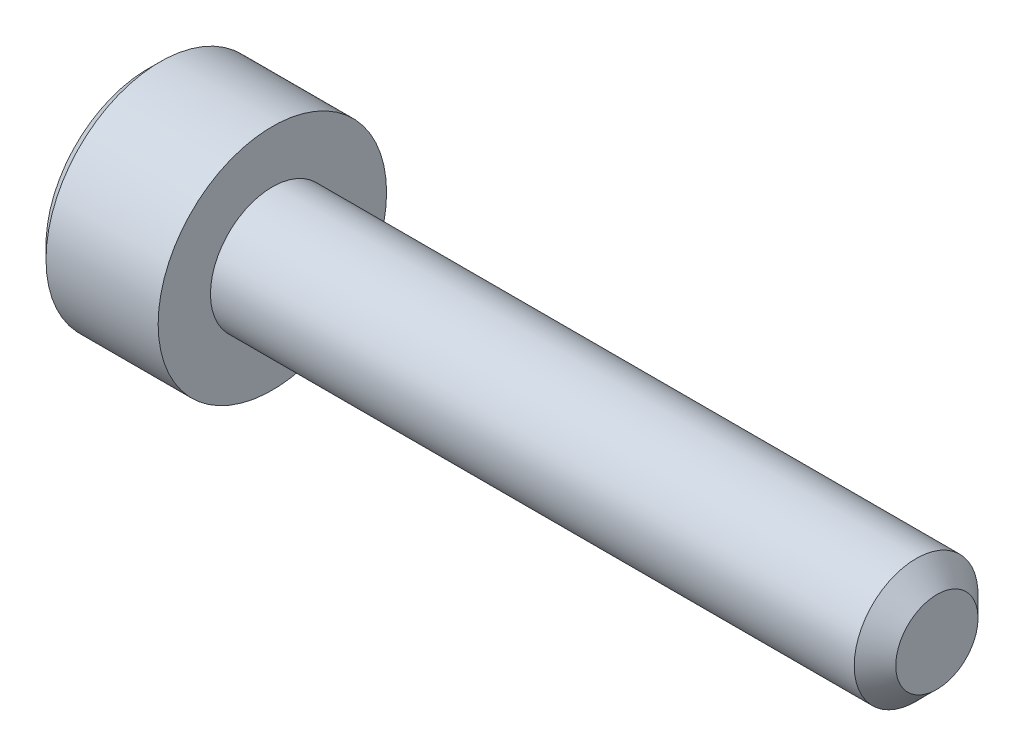
ISO-10303-21;
HEADER;
FILE_DESCRIPTION(('STEP AP214'),'2;1');
FILE_NAME('part.step','',(''),(''),'','','');
FILE_SCHEMA(('AUTOMOTIVE_DESIGN { 1 0 10303 214 1 1 1 1 }'));
ENDSEC;
DATA;
#1=APPLICATION_CONTEXT('core data for automotive mechanical design processes');
#2=APPLICATION_PROTOCOL_DEFINITION('international standard','automotive_design',2000,#1);
#3=PRODUCT_CONTEXT('',#1,'mechanical');
#4=PRODUCT('Part','Part','',(#3));
#5=PRODUCT_RELATED_PRODUCT_CATEGORY('part','',(#4));
#6=PRODUCT_DEFINITION_FORMATION('','',#4);
#7=PRODUCT_DEFINITION_CONTEXT('part definition',#1,'design');
#8=PRODUCT_DEFINITION('design','',#6,#7);
#9=PRODUCT_DEFINITION_SHAPE('','',#8);
#10=(LENGTH_UNIT() NAMED_UNIT(*) SI_UNIT(.MILLI.,.METRE.));
#11=(NAMED_UNIT(*) PLANE_ANGLE_UNIT() SI_UNIT($,.RADIAN.));
#12=(NAMED_UNIT(*) SI_UNIT($,.STERADIAN.) SOLID_ANGLE_UNIT());
#13=UNCERTAINTY_MEASURE_WITH_UNIT(LENGTH_MEASURE(1.E-05),#10,'distance_accuracy_value','');
#14=(GEOMETRIC_REPRESENTATION_CONTEXT(3) GLOBAL_UNCERTAINTY_ASSIGNED_CONTEXT((#13)) GLOBAL_UNIT_ASSIGNED_CONTEXT((#10,
#11,#12)) REPRESENTATION_CONTEXT('',''));
#15=CARTESIAN_POINT('',(0.,0.,0.));
#16=DIRECTION('',(0.,0.,1.));
#17=DIRECTION('',(1.,0.,0.));
#18=AXIS2_PLACEMENT_3D('',#15,#16,#17);
#19=CARTESIAN_POINT('',(0.,0.,0.));
#20=DIRECTION('',(1.,0.,0.));
#21=DIRECTION('',(0.,0.,-1.));
#22=AXIS2_PLACEMENT_3D('',#19,#20,#21);
#23=PLANE('',#22);
#24=DIRECTION('',(0.,0.866025403784439,0.5));
#25=VECTOR('',#24,1.);
#26=CARTESIAN_POINT('',(0.,1.4,-0.98149545762236));
#27=LINE('',#26,#25);
#28=CARTESIAN_POINT('',(0.,0.,-1.78978583448784));
#29=VERTEX_POINT('',#28);
#30=CARTESIAN_POINT('',(0.,1.55,-0.894892917243917));
#31=VERTEX_POINT('',#30);
#32=EDGE_CURVE('E154',#29,#31,#27,.T.);
#33=ORIENTED_EDGE('',*,*,#32,.T.);
#34=DIRECTION('',(0.,0.,1.));
#35=VECTOR('',#34,1.);
#36=CARTESIAN_POINT('',(0.,1.55,0.721687836487032));
#37=LINE('',#36,#35);
#38=CARTESIAN_POINT('',(0.,1.55,0.894892917243918));
#39=VERTEX_POINT('',#38);
#40=EDGE_CURVE('E164',#31,#39,#37,.T.);
#41=ORIENTED_EDGE('',*,*,#40,.T.);
#42=DIRECTION('',(0.,-0.866025403784439,0.5));
#43=VECTOR('',#42,1.);
#44=CARTESIAN_POINT('',(0.,0.149999999999999,1.7031832941094));
#45=LINE('',#44,#43);
#46=CARTESIAN_POINT('',(0.,0.,1.78978583448784));
#47=VERTEX_POINT('',#46);
#48=EDGE_CURVE('E162',#39,#47,#45,.T.);
#49=ORIENTED_EDGE('',*,*,#48,.T.);
#50=DIRECTION('',(0.,-0.866025403784439,-0.5));
#51=VECTOR('',#50,1.);
#52=CARTESIAN_POINT('',(0.,-1.4,0.981495457622362));
#53=LINE('',#52,#51);
#54=CARTESIAN_POINT('',(0.,-1.55,0.894892917243919));
#55=VERTEX_POINT('',#54);
#56=EDGE_CURVE('E160',#47,#55,#53,.T.);
#57=ORIENTED_EDGE('',*,*,#56,.T.);
#58=DIRECTION('',(0.,0.,-1.));
#59=VECTOR('',#58,1.);
#60=CARTESIAN_POINT('',(0.,-1.55,-0.721687836487031));
#61=LINE('',#60,#59);
#62=CARTESIAN_POINT('',(0.,-1.55,-0.894892917243918));
#63=VERTEX_POINT('',#62);
#64=EDGE_CURVE('E158',#55,#63,#61,.T.);
#65=ORIENTED_EDGE('',*,*,#64,.T.);
#66=DIRECTION('',(0.,0.866025403784439,-0.5));
#67=VECTOR('',#66,1.);
#68=CARTESIAN_POINT('',(0.,-0.149999999999998,-1.70318329410939));
#69=LINE('',#68,#67);
#70=EDGE_CURVE('E156',#63,#29,#69,.T.);
#71=ORIENTED_EDGE('',*,*,#70,.T.);
#72=EDGE_LOOP('',(#33,#41,#49,#57,#65,#71));
#73=FACE_BOUND('',#72,.T.);
#74=CARTESIAN_POINT('',(0.,0.,0.));
#75=DIRECTION('',(1.,0.,0.));
#76=DIRECTION('',(0.,0.,-1.));
#77=AXIS2_PLACEMENT_3D('',#74,#75,#76);
#78=CIRCLE('',#77,2.44999999999999);
#79=CARTESIAN_POINT('',(0.,0.,-2.44999999999999));
#80=VERTEX_POINT('',#79);
#81=EDGE_CURVE('E148',#80,#80,#78,.F.);
#82=ORIENTED_EDGE('',*,*,#81,.T.);
#83=EDGE_LOOP('',(#82));
#84=FACE_BOUND('',#83,.T.);
#85=ADVANCED_FACE('F33',(#73,#84),#23,.F.);
#86=CARTESIAN_POINT('',(19.,0.,0.));
#87=DIRECTION('',(-1.,0.,0.));
#88=DIRECTION('',(0.,0.,1.));
#89=AXIS2_PLACEMENT_3D('',#86,#87,#88);
#90=PLANE('',#89);
#91=CARTESIAN_POINT('',(19.,0.,0.));
#92=DIRECTION('',(-1.,0.,0.));
#93=DIRECTION('',(0.,0.,1.));
#94=AXIS2_PLACEMENT_3D('',#91,#92,#93);
#95=CIRCLE('',#94,0.989999999999996);
#96=CARTESIAN_POINT('',(19.,0.,0.989999999999996));
#97=VERTEX_POINT('',#96);
#98=EDGE_CURVE('E145',#97,#97,#95,.F.);
#99=ORIENTED_EDGE('',*,*,#98,.T.);
#100=EDGE_LOOP('',(#99));
#101=FACE_BOUND('',#100,.T.);
#102=ADVANCED_FACE('F244',(#101),#90,.F.);
#103=CARTESIAN_POINT('',(-88.7054908485857,0.,0.));
#104=DIRECTION('',(-1.,0.,0.));
#105=DIRECTION('',(0.,0.,1.));
#106=AXIS2_PLACEMENT_3D('',#103,#104,#105);
#107=CYLINDRICAL_SURFACE('',#106,1.49);
#108=CARTESIAN_POINT('',(18.5,0.,0.));
#109=DIRECTION('',(-1.,0.,0.));
#110=DIRECTION('',(0.,0.,1.));
#111=AXIS2_PLACEMENT_3D('',#108,#109,#110);
#112=CIRCLE('',#111,1.49);
#113=CARTESIAN_POINT('',(18.5,0.,1.49));
#114=VERTEX_POINT('',#113);
#115=EDGE_CURVE('E142',#114,#114,#112,.T.);
#116=ORIENTED_EDGE('',*,*,#115,.T.);
#117=EDGE_LOOP('',(#116));
#118=FACE_BOUND('',#117,.T.);
#119=CARTESIAN_POINT('',(3.,0.,0.));
#120=DIRECTION('',(-1.,0.,0.));
#121=DIRECTION('',(0.,0.,1.));
#122=AXIS2_PLACEMENT_3D('',#119,#120,#121);
#123=CIRCLE('',#122,1.49);
#124=CARTESIAN_POINT('',(3.,0.,1.49));
#125=VERTEX_POINT('',#124);
#126=EDGE_CURVE('E134',#125,#125,#123,.T.);
#127=ORIENTED_EDGE('',*,*,#126,.F.);
#128=EDGE_LOOP('',(#127));
#129=FACE_BOUND('',#128,.T.);
#130=ADVANCED_FACE('F249',(#118,#129),#107,.T.);
#131=CARTESIAN_POINT('',(3.,1.49,0.));
#132=DIRECTION('',(-1.,0.,0.));
#133=DIRECTION('',(0.,0.,1.));
#134=AXIS2_PLACEMENT_3D('',#131,#132,#133);
#135=PLANE('',#134);
#136=CARTESIAN_POINT('',(3.,0.,0.));
#137=DIRECTION('',(-1.,0.,0.));
#138=DIRECTION('',(0.,0.,1.));
#139=AXIS2_PLACEMENT_3D('',#136,#137,#138);
#140=CIRCLE('',#139,2.75);
#141=CARTESIAN_POINT('',(3.,0.,2.75));
#142=VERTEX_POINT('',#141);
#143=EDGE_CURVE('E130',#142,#142,#140,.T.);
#144=ORIENTED_EDGE('',*,*,#143,.F.);
#145=EDGE_LOOP('',(#144));
#146=FACE_BOUND('',#145,.T.);
#147=ORIENTED_EDGE('',*,*,#126,.T.);
#148=EDGE_LOOP('',(#147));
#149=FACE_BOUND('',#148,.T.);
#150=ADVANCED_FACE('F259',(#146,#149),#135,.F.);
#151=CARTESIAN_POINT('',(-88.7054908485857,0.,0.));
#152=DIRECTION('',(-1.,0.,0.));
#153=DIRECTION('',(0.,0.,1.));
#154=AXIS2_PLACEMENT_3D('',#151,#152,#153);
#155=CYLINDRICAL_SURFACE('',#154,2.75);
#156=CARTESIAN_POINT('',(0.300000000000009,0.,0.));
#157=DIRECTION('',(1.,0.,0.));
#158=DIRECTION('',(0.,0.,-1.));
#159=AXIS2_PLACEMENT_3D('',#156,#157,#158);
#160=CIRCLE('',#159,2.75);
#161=CARTESIAN_POINT('',(0.300000000000009,0.,-2.75));
#162=VERTEX_POINT('',#161);
#163=EDGE_CURVE('E151',#162,#162,#160,.T.);
#164=ORIENTED_EDGE('',*,*,#163,.T.);
#165=EDGE_LOOP('',(#164));
#166=FACE_BOUND('',#165,.T.);
#167=ORIENTED_EDGE('',*,*,#143,.T.);
#168=EDGE_LOOP('',(#167));
#169=FACE_BOUND('',#168,.T.);
#170=ADVANCED_FACE('F255',(#166,#169),#155,.T.);
#171=CARTESIAN_POINT('',(18.5,0.,0.));
#172=DIRECTION('',(-1.,0.,0.));
#173=DIRECTION('',(0.,0.,1.));
#174=AXIS2_PLACEMENT_3D('',#171,#172,#173);
#175=CONICAL_SURFACE('',#174,1.49,0.785398163397454);
#176=ORIENTED_EDGE('',*,*,#98,.F.);
#177=EDGE_LOOP('',(#176));
#178=FACE_BOUND('',#177,.T.);
#179=ORIENTED_EDGE('',*,*,#115,.F.);
#180=EDGE_LOOP('',(#179));
#181=FACE_BOUND('',#180,.T.);
#182=ADVANCED_FACE('F258',(#178,#181),#175,.T.);
#183=CARTESIAN_POINT('',(0.,0.,0.));
#184=DIRECTION('',(1.,0.,0.));
#185=DIRECTION('',(0.,0.,-1.));
#186=AXIS2_PLACEMENT_3D('',#183,#184,#185);
#187=CONICAL_SURFACE('',#186,2.44999999999999,0.78539816339745);
#188=ORIENTED_EDGE('',*,*,#163,.F.);
#189=EDGE_LOOP('',(#188));
#190=FACE_BOUND('',#189,.T.);
#191=ORIENTED_EDGE('',*,*,#81,.F.);
#192=EDGE_LOOP('',(#191));
#193=FACE_BOUND('',#192,.T.);
#194=ADVANCED_FACE('F269',(#190,#193),#187,.T.);
#195=CARTESIAN_POINT('',(2.5,1.25,0.721687836487032));
#196=DIRECTION('',(0.,-0.5,-0.866025403784438));
#197=DIRECTION('',(0.,0.866025403784439,-0.5));
#198=AXIS2_PLACEMENT_3D('',#195,#196,#197);
#199=PLANE('',#198);
#200=DIRECTION('',(-1.,0.,0.));
#201=VECTOR('',#200,1.);
#202=CARTESIAN_POINT('',(2.5,0.,1.44337567297407));
#203=LINE('',#202,#201);
#204=CARTESIAN_POINT('',(2.5,0.,1.44337567297407));
#205=VERTEX_POINT('',#204);
#206=CARTESIAN_POINT('',(0.299999999999998,0.,1.44337567297407));
#207=VERTEX_POINT('',#206);
#208=EDGE_CURVE('E122',#205,#207,#203,.T.);
#209=ORIENTED_EDGE('',*,*,#208,.T.);
#210=DIRECTION('',(0.,0.866025403784439,-0.5));
#211=VECTOR('',#210,1.);
#212=CARTESIAN_POINT('',(0.299999999999998,1.25,0.721687836487032));
#213=LINE('',#212,#211);
#214=CARTESIAN_POINT('',(0.299999999999998,1.25,0.721687836487032));
#215=VERTEX_POINT('',#214);
#216=EDGE_CURVE('E170',#207,#215,#213,.T.);
#217=ORIENTED_EDGE('',*,*,#216,.T.);
#218=DIRECTION('',(-1.,0.,0.));
#219=VECTOR('',#218,1.);
#220=CARTESIAN_POINT('',(2.5,1.25,0.721687836487032));
#221=LINE('',#220,#219);
#222=CARTESIAN_POINT('',(2.5,1.25,0.721687836487032));
#223=VERTEX_POINT('',#222);
#224=EDGE_CURVE('E125',#223,#215,#221,.T.);
#225=ORIENTED_EDGE('',*,*,#224,.F.);
#226=DIRECTION('',(0.,-0.866025403784439,0.5));
#227=VECTOR('',#226,1.);
#228=CARTESIAN_POINT('',(2.5,1.25,0.721687836487032));
#229=LINE('',#228,#227);
#230=EDGE_CURVE('E110',#223,#205,#229,.T.);
#231=ORIENTED_EDGE('',*,*,#230,.T.);
#232=EDGE_LOOP('',(#209,#217,#225,#231));
#233=FACE_BOUND('',#232,.T.);
#234=ADVANCED_FACE('F121',(#233),#199,.T.);
#235=CARTESIAN_POINT('',(2.5,0.,1.44337567297407));
#236=DIRECTION('',(0.,0.5,-0.866025403784438));
#237=DIRECTION('',(0.,0.866025403784439,0.5));
#238=AXIS2_PLACEMENT_3D('',#235,#236,#237);
#239=PLANE('',#238);
#240=DIRECTION('',(-1.,0.,0.));
#241=VECTOR('',#240,1.);
#242=CARTESIAN_POINT('',(2.5,-1.25,0.721687836487033));
#243=LINE('',#242,#241);
#244=CARTESIAN_POINT('',(2.5,-1.25,0.721687836487033));
#245=VERTEX_POINT('',#244);
#246=CARTESIAN_POINT('',(0.299999999999998,-1.25,0.721687836487033));
#247=VERTEX_POINT('',#246);
#248=EDGE_CURVE('E131',#245,#247,#243,.T.);
#249=ORIENTED_EDGE('',*,*,#248,.T.);
#250=DIRECTION('',(0.,0.866025403784439,0.5));
#251=VECTOR('',#250,1.);
#252=CARTESIAN_POINT('',(0.299999999999998,0.,1.44337567297407));
#253=LINE('',#252,#251);
#254=EDGE_CURVE('E129',#247,#207,#253,.T.);
#255=ORIENTED_EDGE('',*,*,#254,.T.);
#256=ORIENTED_EDGE('',*,*,#208,.F.);
#257=DIRECTION('',(0.,-0.866025403784439,-0.5));
#258=VECTOR('',#257,1.);
#259=CARTESIAN_POINT('',(2.5,0.,1.44337567297407));
#260=LINE('',#259,#258);
#261=EDGE_CURVE('E106',#205,#245,#260,.T.);
#262=ORIENTED_EDGE('',*,*,#261,.T.);
#263=EDGE_LOOP('',(#249,#255,#256,#262));
#264=FACE_BOUND('',#263,.T.);
#265=ADVANCED_FACE('F127',(#264),#239,.T.);
#266=CARTESIAN_POINT('',(2.5,-1.25,0.721687836487033));
#267=DIRECTION('',(0.,1.,0.));
#268=DIRECTION('',(0.,0.,1.));
#269=AXIS2_PLACEMENT_3D('',#266,#267,#268);
#270=PLANE('',#269);
#271=DIRECTION('',(-1.,0.,0.));
#272=VECTOR('',#271,1.);
#273=CARTESIAN_POINT('',(2.5,-1.25,-0.721687836487031));
#274=LINE('',#273,#272);
#275=CARTESIAN_POINT('',(2.5,-1.25,-0.721687836487031));
#276=VERTEX_POINT('',#275);
#277=CARTESIAN_POINT('',(0.299999999999998,-1.25,-0.721687836487031));
#278=VERTEX_POINT('',#277);
#279=EDGE_CURVE('E136',#276,#278,#274,.T.);
#280=ORIENTED_EDGE('',*,*,#279,.T.);
#281=DIRECTION('',(0.,0.,1.));
#282=VECTOR('',#281,1.);
#283=CARTESIAN_POINT('',(0.299999999999998,-1.25,0.721687836487033));
#284=LINE('',#283,#282);
#285=EDGE_CURVE('E173',#278,#247,#284,.T.);
#286=ORIENTED_EDGE('',*,*,#285,.T.);
#287=ORIENTED_EDGE('',*,*,#248,.F.);
#288=DIRECTION('',(0.,0.,-1.));
#289=VECTOR('',#288,1.);
#290=CARTESIAN_POINT('',(2.5,-1.25,0.721687836487033));
#291=LINE('',#290,#289);
#292=EDGE_CURVE('E112',#245,#276,#291,.T.);
#293=ORIENTED_EDGE('',*,*,#292,.T.);
#294=EDGE_LOOP('',(#280,#286,#287,#293));
#295=FACE_BOUND('',#294,.T.);
#296=ADVANCED_FACE('F200',(#295),#270,.T.);
#297=CARTESIAN_POINT('',(2.5,-1.25,-0.721687836487031));
#298=DIRECTION('',(0.,0.5,0.866025403784439));
#299=DIRECTION('',(0.,-0.866025403784439,0.5));
#300=AXIS2_PLACEMENT_3D('',#297,#298,#299);
#301=PLANE('',#300);
#302=DIRECTION('',(-1.,0.,0.));
#303=VECTOR('',#302,1.);
#304=CARTESIAN_POINT('',(2.5,0.,-1.44337567297406));
#305=LINE('',#304,#303);
#306=CARTESIAN_POINT('',(2.5,0.,-1.44337567297406));
#307=VERTEX_POINT('',#306);
#308=CARTESIAN_POINT('',(0.299999999999998,0.,-1.44337567297406));
#309=VERTEX_POINT('',#308);
#310=EDGE_CURVE('E201',#307,#309,#305,.T.);
#311=ORIENTED_EDGE('',*,*,#310,.T.);
#312=DIRECTION('',(0.,-0.866025403784439,0.5));
#313=VECTOR('',#312,1.);
#314=CARTESIAN_POINT('',(0.299999999999998,-1.25,-0.721687836487031));
#315=LINE('',#314,#313);
#316=EDGE_CURVE('E42',#309,#278,#315,.T.);
#317=ORIENTED_EDGE('',*,*,#316,.T.);
#318=ORIENTED_EDGE('',*,*,#279,.F.);
#319=DIRECTION('',(0.,0.866025403784439,-0.499999999999999));
#320=VECTOR('',#319,1.);
#321=CARTESIAN_POINT('',(2.5,-1.25,-0.721687836487031));
#322=LINE('',#321,#320);
#323=EDGE_CURVE('E211',#276,#307,#322,.T.);
#324=ORIENTED_EDGE('',*,*,#323,.T.);
#325=EDGE_LOOP('',(#311,#317,#318,#324));
#326=FACE_BOUND('',#325,.T.);
#327=ADVANCED_FACE('F213',(#326),#301,.T.);
#328=CARTESIAN_POINT('',(2.5,0.,-1.44337567297406));
#329=DIRECTION('',(0.,-0.5,0.866025403784439));
#330=DIRECTION('',(0.,-0.866025403784439,-0.5));
#331=AXIS2_PLACEMENT_3D('',#328,#329,#330);
#332=PLANE('',#331);
#333=DIRECTION('',(-1.,0.,0.));
#334=VECTOR('',#333,1.);
#335=CARTESIAN_POINT('',(2.5,1.25,-0.72168783648703));
#336=LINE('',#335,#334);
#337=CARTESIAN_POINT('',(2.5,1.25,-0.72168783648703));
#338=VERTEX_POINT('',#337);
#339=CARTESIAN_POINT('',(0.299999999999998,1.25,-0.72168783648703));
#340=VERTEX_POINT('',#339);
#341=EDGE_CURVE('E202',#338,#340,#336,.T.);
#342=ORIENTED_EDGE('',*,*,#341,.T.);
#343=DIRECTION('',(0.,-0.866025403784439,-0.5));
#344=VECTOR('',#343,1.);
#345=CARTESIAN_POINT('',(0.299999999999998,0.,-1.44337567297406));
#346=LINE('',#345,#344);
#347=EDGE_CURVE('E11',#340,#309,#346,.T.);
#348=ORIENTED_EDGE('',*,*,#347,.T.);
#349=ORIENTED_EDGE('',*,*,#310,.F.);
#350=DIRECTION('',(0.,0.866025403784438,0.5));
#351=VECTOR('',#350,1.);
#352=CARTESIAN_POINT('',(2.5,0.,-1.44337567297406));
#353=LINE('',#352,#351);
#354=EDGE_CURVE('E209',#307,#338,#353,.T.);
#355=ORIENTED_EDGE('',*,*,#354,.T.);
#356=EDGE_LOOP('',(#342,#348,#349,#355));
#357=FACE_BOUND('',#356,.T.);
#358=ADVANCED_FACE('F215',(#357),#332,.T.);
#359=CARTESIAN_POINT('',(2.5,1.25,-0.72168783648703));
#360=DIRECTION('',(0.,-1.,0.));
#361=DIRECTION('',(0.,0.,-1.));
#362=AXIS2_PLACEMENT_3D('',#359,#360,#361);
#363=PLANE('',#362);
#364=ORIENTED_EDGE('',*,*,#224,.T.);
#365=DIRECTION('',(0.,0.,-1.));
#366=VECTOR('',#365,1.);
#367=CARTESIAN_POINT('',(0.299999999999998,1.25,-0.72168783648703));
#368=LINE('',#367,#366);
#369=EDGE_CURVE('E167',#215,#340,#368,.T.);
#370=ORIENTED_EDGE('',*,*,#369,.T.);
#371=ORIENTED_EDGE('',*,*,#341,.F.);
#372=DIRECTION('',(0.,0.,1.));
#373=VECTOR('',#372,1.);
#374=CARTESIAN_POINT('',(2.5,1.25,-0.72168783648703));
#375=LINE('',#374,#373);
#376=EDGE_CURVE('E207',#338,#223,#375,.T.);
#377=ORIENTED_EDGE('',*,*,#376,.T.);
#378=EDGE_LOOP('',(#364,#370,#371,#377));
#379=FACE_BOUND('',#378,.T.);
#380=ADVANCED_FACE('F218',(#379),#363,.T.);
#381=CARTESIAN_POINT('',(2.5,0.,0.));
#382=DIRECTION('',(1.,0.,0.));
#383=DIRECTION('',(0.,0.,-1.));
#384=AXIS2_PLACEMENT_3D('',#381,#382,#383);
#385=PLANE('',#384);
#386=ORIENTED_EDGE('',*,*,#230,.F.);
#387=ORIENTED_EDGE('',*,*,#376,.F.);
#388=ORIENTED_EDGE('',*,*,#354,.F.);
#389=ORIENTED_EDGE('',*,*,#323,.F.);
#390=ORIENTED_EDGE('',*,*,#292,.F.);
#391=ORIENTED_EDGE('',*,*,#261,.F.);
#392=EDGE_LOOP('',(#386,#387,#388,#389,#390,#391));
#393=FACE_BOUND('',#392,.T.);
#394=ADVANCED_FACE('F108',(#393),#385,.F.);
#395=CARTESIAN_POINT('',(0.,-1.55,0.));
#396=DIRECTION('',(-0.707106781186547,0.707106781186548,0.));
#397=DIRECTION('',(0.,0.,1.));
#398=AXIS2_PLACEMENT_3D('',#395,#396,#397);
#399=PLANE('',#398);
#400=DIRECTION('',(0.654653670707978,0.654653670707977,-0.377964473009227));
#401=VECTOR('',#400,1.);
#402=CARTESIAN_POINT('',(0.221428571428572,-1.32857142857143,0.767051071923359));
#403=LINE('',#402,#401);
#404=EDGE_CURVE('E185',#247,#55,#403,.F.);
#405=ORIENTED_EDGE('',*,*,#404,.F.);
#406=ORIENTED_EDGE('',*,*,#285,.F.);
#407=DIRECTION('',(0.654653670707977,0.654653670707977,0.377964473009228));
#408=VECTOR('',#407,1.);
#409=CARTESIAN_POINT('',(0.221428571428571,-1.32857142857143,-0.767051071923358));
#410=LINE('',#409,#408);
#411=EDGE_CURVE('E37',#63,#278,#410,.T.);
#412=ORIENTED_EDGE('',*,*,#411,.F.);
#413=ORIENTED_EDGE('',*,*,#64,.F.);
#414=EDGE_LOOP('',(#405,#406,#412,#413));
#415=FACE_BOUND('',#414,.T.);
#416=ADVANCED_FACE('F35',(#415),#399,.T.);
#417=CARTESIAN_POINT('',(0.,-0.774999999999998,-1.34233937586588));
#418=DIRECTION('',(-0.707106781186547,0.353553390593273,0.612372435695795));
#419=DIRECTION('',(0.,-0.866025403784439,0.5));
#420=AXIS2_PLACEMENT_3D('',#417,#418,#419);
#421=PLANE('',#420);
#422=ORIENTED_EDGE('',*,*,#411,.T.);
#423=ORIENTED_EDGE('',*,*,#316,.F.);
#424=DIRECTION('',(0.654653670707977,0.,0.755928946018454));
#425=VECTOR('',#424,1.);
#426=CARTESIAN_POINT('',(0.221428571428571,0.,-1.53410214384672));
#427=LINE('',#426,#425);
#428=EDGE_CURVE('E183',#29,#309,#427,.T.);
#429=ORIENTED_EDGE('',*,*,#428,.F.);
#430=ORIENTED_EDGE('',*,*,#70,.F.);
#431=EDGE_LOOP('',(#422,#423,#429,#430));
#432=FACE_BOUND('',#431,.T.);
#433=ADVANCED_FACE('F194',(#432),#421,.T.);
#434=CARTESIAN_POINT('',(0.,-0.775,1.34233937586588));
#435=DIRECTION('',(-0.707106781186547,0.353553390593274,-0.612372435695795));
#436=DIRECTION('',(0.,0.866025403784439,0.5));
#437=AXIS2_PLACEMENT_3D('',#434,#435,#436);
#438=PLANE('',#437);
#439=ORIENTED_EDGE('',*,*,#404,.T.);
#440=ORIENTED_EDGE('',*,*,#56,.F.);
#441=DIRECTION('',(0.654653670707978,0.,-0.755928946018454));
#442=VECTOR('',#441,1.);
#443=CARTESIAN_POINT('',(0.221428571428571,0.,1.53410214384672));
#444=LINE('',#443,#442);
#445=EDGE_CURVE('E180',#207,#47,#444,.F.);
#446=ORIENTED_EDGE('',*,*,#445,.F.);
#447=ORIENTED_EDGE('',*,*,#254,.F.);
#448=EDGE_LOOP('',(#439,#440,#446,#447));
#449=FACE_BOUND('',#448,.T.);
#450=ADVANCED_FACE('F235',(#449),#438,.T.);
#451=CARTESIAN_POINT('',(0.,0.774999999999999,-1.34233937586588));
#452=DIRECTION('',(-0.707106781186547,-0.353553390593274,0.612372435695795));
#453=DIRECTION('',(0.,-0.866025403784439,-0.5));
#454=AXIS2_PLACEMENT_3D('',#451,#452,#453);
#455=PLANE('',#454);
#456=ORIENTED_EDGE('',*,*,#428,.T.);
#457=ORIENTED_EDGE('',*,*,#347,.F.);
#458=DIRECTION('',(-0.654653670707977,0.654653670707977,-0.377964473009227));
#459=VECTOR('',#458,1.);
#460=CARTESIAN_POINT('',(0.221428571428571,1.32857142857143,-0.767051071923358));
#461=LINE('',#460,#459);
#462=EDGE_CURVE('E178',#31,#340,#461,.F.);
#463=ORIENTED_EDGE('',*,*,#462,.F.);
#464=ORIENTED_EDGE('',*,*,#32,.F.);
#465=EDGE_LOOP('',(#456,#457,#463,#464));
#466=FACE_BOUND('',#465,.T.);
#467=ADVANCED_FACE('F233',(#466),#455,.T.);
#468=CARTESIAN_POINT('',(0.,0.775,1.34233937586588));
#469=DIRECTION('',(-0.707106781186547,-0.353553390593274,-0.612372435695795));
#470=DIRECTION('',(0.,0.866025403784439,-0.5));
#471=AXIS2_PLACEMENT_3D('',#468,#469,#470);
#472=PLANE('',#471);
#473=ORIENTED_EDGE('',*,*,#445,.T.);
#474=ORIENTED_EDGE('',*,*,#48,.F.);
#475=DIRECTION('',(0.654653670707977,-0.654653670707977,-0.377964473009227));
#476=VECTOR('',#475,1.);
#477=CARTESIAN_POINT('',(0.221428571428571,1.32857142857143,0.767051071923359));
#478=LINE('',#477,#476);
#479=EDGE_CURVE('E176',#215,#39,#478,.F.);
#480=ORIENTED_EDGE('',*,*,#479,.F.);
#481=ORIENTED_EDGE('',*,*,#216,.F.);
#482=EDGE_LOOP('',(#473,#474,#480,#481));
#483=FACE_BOUND('',#482,.T.);
#484=ADVANCED_FACE('F228',(#483),#472,.T.);
#485=CARTESIAN_POINT('',(0.,1.55,0.));
#486=DIRECTION('',(-0.707106781186547,-0.707106781186548,0.));
#487=DIRECTION('',(0.,0.,-1.));
#488=AXIS2_PLACEMENT_3D('',#485,#486,#487);
#489=PLANE('',#488);
#490=ORIENTED_EDGE('',*,*,#462,.T.);
#491=ORIENTED_EDGE('',*,*,#369,.F.);
#492=ORIENTED_EDGE('',*,*,#479,.T.);
#493=ORIENTED_EDGE('',*,*,#40,.F.);
#494=EDGE_LOOP('',(#490,#491,#492,#493));
#495=FACE_BOUND('',#494,.T.);
#496=ADVANCED_FACE('F222',(#495),#489,.T.);
#497=CLOSED_SHELL('',(#85,#102,#130,#150,#170,#182,#194,#234,#265,#296,#327,#358,#380,#394,#416,
#433,#450,#467,#484,#496));
#498=MANIFOLD_SOLID_BREP('B2',#497);
#499=ADVANCED_BREP_SHAPE_REPRESENTATION('',(#18,#498),#14);
#500=SHAPE_DEFINITION_REPRESENTATION(#9,#499);
ENDSEC;
END-ISO-10303-21;
